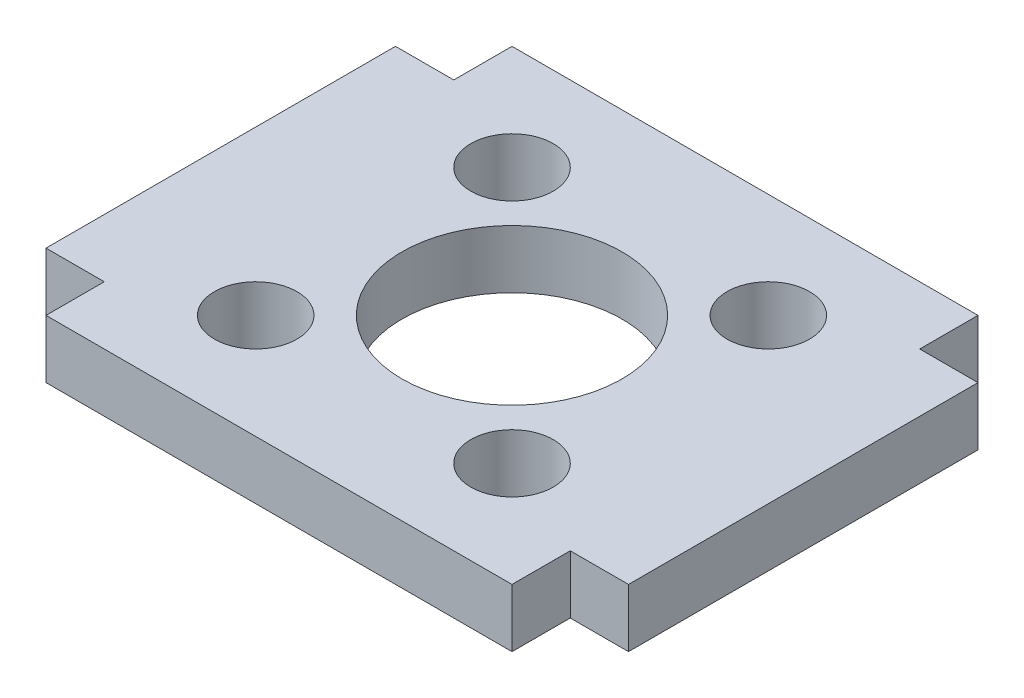
ISO-10303-21;
HEADER;
FILE_DESCRIPTION(('STEP AP214'),'2;1');
FILE_NAME('part.step','',(''),(''),'','','');
FILE_SCHEMA(('AUTOMOTIVE_DESIGN { 1 0 10303 214 1 1 1 1 }'));
ENDSEC;
DATA;
#1=APPLICATION_CONTEXT('core data for automotive mechanical design processes');
#2=APPLICATION_PROTOCOL_DEFINITION('international standard','automotive_design',2000,#1);
#3=PRODUCT_CONTEXT('',#1,'mechanical');
#4=PRODUCT('Part','Part','',(#3));
#5=PRODUCT_RELATED_PRODUCT_CATEGORY('part','',(#4));
#6=PRODUCT_DEFINITION_FORMATION('','',#4);
#7=PRODUCT_DEFINITION_CONTEXT('part definition',#1,'design');
#8=PRODUCT_DEFINITION('design','',#6,#7);
#9=PRODUCT_DEFINITION_SHAPE('','',#8);
#10=(LENGTH_UNIT() NAMED_UNIT(*) SI_UNIT(.MILLI.,.METRE.));
#11=(NAMED_UNIT(*) PLANE_ANGLE_UNIT() SI_UNIT($,.RADIAN.));
#12=(NAMED_UNIT(*) SI_UNIT($,.STERADIAN.) SOLID_ANGLE_UNIT());
#13=UNCERTAINTY_MEASURE_WITH_UNIT(LENGTH_MEASURE(1.E-05),#10,'distance_accuracy_value','');
#14=(GEOMETRIC_REPRESENTATION_CONTEXT(3) GLOBAL_UNCERTAINTY_ASSIGNED_CONTEXT((#13)) GLOBAL_UNIT_ASSIGNED_CONTEXT((#10,
#11,#12)) REPRESENTATION_CONTEXT('',''));
#15=CARTESIAN_POINT('',(0.,0.,0.));
#16=DIRECTION('',(0.,0.,1.));
#17=DIRECTION('',(1.,0.,0.));
#18=AXIS2_PLACEMENT_3D('',#15,#16,#17);
#19=CARTESIAN_POINT('',(-12.7,3.175,-9.52500000000001));
#20=DIRECTION('',(1.,0.,0.));
#21=DIRECTION('',(0.,0.,-1.));
#22=AXIS2_PLACEMENT_3D('',#19,#20,#21);
#23=PLANE('',#22);
#24=DIRECTION('',(0.,0.,1.));
#25=VECTOR('',#24,1.);
#26=CARTESIAN_POINT('',(-12.7,0.,-9.52500000000001));
#27=LINE('',#26,#25);
#28=CARTESIAN_POINT('',(-12.7,0.,-12.7));
#29=VERTEX_POINT('',#28);
#30=CARTESIAN_POINT('',(-12.7,0.,-9.52500000000001));
#31=VERTEX_POINT('',#30);
#32=EDGE_CURVE('E179',#29,#31,#27,.T.);
#33=ORIENTED_EDGE('',*,*,#32,.T.);
#34=DIRECTION('',(0.,-1.,0.));
#35=VECTOR('',#34,1.);
#36=CARTESIAN_POINT('',(-12.7,3.175,-9.52500000000001));
#37=LINE('',#36,#35);
#38=CARTESIAN_POINT('',(-12.7,3.175,-9.52500000000001));
#39=VERTEX_POINT('',#38);
#40=EDGE_CURVE('E11',#39,#31,#37,.T.);
#41=ORIENTED_EDGE('',*,*,#40,.F.);
#42=DIRECTION('',(0.,0.,1.));
#43=VECTOR('',#42,1.);
#44=CARTESIAN_POINT('',(-12.7,3.175,-9.52500000000001));
#45=LINE('',#44,#43);
#46=CARTESIAN_POINT('',(-12.7,3.175,-12.7));
#47=VERTEX_POINT('',#46);
#48=EDGE_CURVE('E208',#47,#39,#45,.T.);
#49=ORIENTED_EDGE('',*,*,#48,.F.);
#50=DIRECTION('',(0.,-1.,0.));
#51=VECTOR('',#50,1.);
#52=CARTESIAN_POINT('',(-12.7,3.175,-12.7));
#53=LINE('',#52,#51);
#54=EDGE_CURVE('E175',#47,#29,#53,.T.);
#55=ORIENTED_EDGE('',*,*,#54,.T.);
#56=EDGE_LOOP('',(#33,#41,#49,#55));
#57=FACE_BOUND('',#56,.T.);
#58=ADVANCED_FACE('F43',(#57),#23,.F.);
#59=CARTESIAN_POINT('',(-12.7,3.175,-9.52500000000001));
#60=DIRECTION('',(0.,0.,1.));
#61=DIRECTION('',(1.,0.,0.));
#62=AXIS2_PLACEMENT_3D('',#59,#60,#61);
#63=PLANE('',#62);
#64=DIRECTION('',(-1.,0.,0.));
#65=VECTOR('',#64,1.);
#66=CARTESIAN_POINT('',(-12.7,0.,-9.52500000000001));
#67=LINE('',#66,#65);
#68=CARTESIAN_POINT('',(-15.875,0.,-9.52500000000001));
#69=VERTEX_POINT('',#68);
#70=EDGE_CURVE('E183',#31,#69,#67,.T.);
#71=ORIENTED_EDGE('',*,*,#70,.T.);
#72=DIRECTION('',(0.,-1.,0.));
#73=VECTOR('',#72,1.);
#74=CARTESIAN_POINT('',(-15.875,3.175,-9.52500000000001));
#75=LINE('',#74,#73);
#76=CARTESIAN_POINT('',(-15.875,3.175,-9.52500000000001));
#77=VERTEX_POINT('',#76);
#78=EDGE_CURVE('E52',#77,#69,#75,.T.);
#79=ORIENTED_EDGE('',*,*,#78,.F.);
#80=DIRECTION('',(-1.,0.,0.));
#81=VECTOR('',#80,1.);
#82=CARTESIAN_POINT('',(-12.7,3.175,-9.52500000000001));
#83=LINE('',#82,#81);
#84=EDGE_CURVE('E125',#39,#77,#83,.T.);
#85=ORIENTED_EDGE('',*,*,#84,.F.);
#86=ORIENTED_EDGE('',*,*,#40,.T.);
#87=EDGE_LOOP('',(#71,#79,#85,#86));
#88=FACE_BOUND('',#87,.T.);
#89=ADVANCED_FACE('F290',(#88),#63,.F.);
#90=CARTESIAN_POINT('',(-15.875,3.175,-9.52500000000001));
#91=DIRECTION('',(1.,0.,0.));
#92=DIRECTION('',(0.,0.,-1.));
#93=AXIS2_PLACEMENT_3D('',#90,#91,#92);
#94=PLANE('',#93);
#95=DIRECTION('',(0.,0.,1.));
#96=VECTOR('',#95,1.);
#97=CARTESIAN_POINT('',(-15.875,0.,-9.52500000000001));
#98=LINE('',#97,#96);
#99=CARTESIAN_POINT('',(-15.875,0.,9.52499999999999));
#100=VERTEX_POINT('',#99);
#101=EDGE_CURVE('E187',#69,#100,#98,.T.);
#102=ORIENTED_EDGE('',*,*,#101,.T.);
#103=DIRECTION('',(0.,-1.,0.));
#104=VECTOR('',#103,1.);
#105=CARTESIAN_POINT('',(-15.875,3.175,9.52499999999999));
#106=LINE('',#105,#104);
#107=CARTESIAN_POINT('',(-15.875,3.175,9.52499999999999));
#108=VERTEX_POINT('',#107);
#109=EDGE_CURVE('E228',#108,#100,#106,.T.);
#110=ORIENTED_EDGE('',*,*,#109,.F.);
#111=DIRECTION('',(0.,0.,1.));
#112=VECTOR('',#111,1.);
#113=CARTESIAN_POINT('',(-15.875,3.175,-9.52500000000001));
#114=LINE('',#113,#112);
#115=EDGE_CURVE('E238',#77,#108,#114,.T.);
#116=ORIENTED_EDGE('',*,*,#115,.F.);
#117=ORIENTED_EDGE('',*,*,#78,.T.);
#118=EDGE_LOOP('',(#102,#110,#116,#117));
#119=FACE_BOUND('',#118,.T.);
#120=ADVANCED_FACE('F236',(#119),#94,.F.);
#121=CARTESIAN_POINT('',(-15.875,3.175,9.52499999999999));
#122=DIRECTION('',(0.,0.,-1.));
#123=DIRECTION('',(-1.,0.,0.));
#124=AXIS2_PLACEMENT_3D('',#121,#122,#123);
#125=PLANE('',#124);
#126=DIRECTION('',(1.,0.,0.));
#127=VECTOR('',#126,1.);
#128=CARTESIAN_POINT('',(-15.875,0.,9.52499999999999));
#129=LINE('',#128,#127);
#130=CARTESIAN_POINT('',(-12.7,0.,9.52499999999999));
#131=VERTEX_POINT('',#130);
#132=EDGE_CURVE('E190',#100,#131,#129,.T.);
#133=ORIENTED_EDGE('',*,*,#132,.T.);
#134=DIRECTION('',(0.,-1.,0.));
#135=VECTOR('',#134,1.);
#136=CARTESIAN_POINT('',(-12.7,3.175,9.52499999999999));
#137=LINE('',#136,#135);
#138=CARTESIAN_POINT('',(-12.7,3.175,9.52499999999999));
#139=VERTEX_POINT('',#138);
#140=EDGE_CURVE('E225',#139,#131,#137,.T.);
#141=ORIENTED_EDGE('',*,*,#140,.F.);
#142=DIRECTION('',(1.,0.,0.));
#143=VECTOR('',#142,1.);
#144=CARTESIAN_POINT('',(-15.875,3.175,9.52499999999999));
#145=LINE('',#144,#143);
#146=EDGE_CURVE('E256',#108,#139,#145,.T.);
#147=ORIENTED_EDGE('',*,*,#146,.F.);
#148=ORIENTED_EDGE('',*,*,#109,.T.);
#149=EDGE_LOOP('',(#133,#141,#147,#148));
#150=FACE_BOUND('',#149,.T.);
#151=ADVANCED_FACE('F247',(#150),#125,.F.);
#152=CARTESIAN_POINT('',(-12.7,3.175,12.7));
#153=DIRECTION('',(1.,0.,0.));
#154=DIRECTION('',(0.,0.,-1.));
#155=AXIS2_PLACEMENT_3D('',#152,#153,#154);
#156=PLANE('',#155);
#157=DIRECTION('',(0.,0.,1.));
#158=VECTOR('',#157,1.);
#159=CARTESIAN_POINT('',(-12.7,0.,12.7));
#160=LINE('',#159,#158);
#161=CARTESIAN_POINT('',(-12.7,0.,12.7));
#162=VERTEX_POINT('',#161);
#163=EDGE_CURVE('E192',#131,#162,#160,.T.);
#164=ORIENTED_EDGE('',*,*,#163,.T.);
#165=DIRECTION('',(0.,-1.,0.));
#166=VECTOR('',#165,1.);
#167=CARTESIAN_POINT('',(-12.7,3.175,12.7));
#168=LINE('',#167,#166);
#169=CARTESIAN_POINT('',(-12.7,3.175,12.7));
#170=VERTEX_POINT('',#169);
#171=EDGE_CURVE('E222',#170,#162,#168,.T.);
#172=ORIENTED_EDGE('',*,*,#171,.F.);
#173=DIRECTION('',(0.,0.,1.));
#174=VECTOR('',#173,1.);
#175=CARTESIAN_POINT('',(-12.7,3.175,12.7));
#176=LINE('',#175,#174);
#177=EDGE_CURVE('E253',#139,#170,#176,.T.);
#178=ORIENTED_EDGE('',*,*,#177,.F.);
#179=ORIENTED_EDGE('',*,*,#140,.T.);
#180=EDGE_LOOP('',(#164,#172,#178,#179));
#181=FACE_BOUND('',#180,.T.);
#182=ADVANCED_FACE('F251',(#181),#156,.F.);
#183=CARTESIAN_POINT('',(12.7,3.175,12.7));
#184=DIRECTION('',(0.,0.,-1.));
#185=DIRECTION('',(-1.,0.,0.));
#186=AXIS2_PLACEMENT_3D('',#183,#184,#185);
#187=PLANE('',#186);
#188=DIRECTION('',(1.,0.,0.));
#189=VECTOR('',#188,1.);
#190=CARTESIAN_POINT('',(12.7,0.,12.7));
#191=LINE('',#190,#189);
#192=CARTESIAN_POINT('',(12.7,0.,12.7));
#193=VERTEX_POINT('',#192);
#194=EDGE_CURVE('E194',#162,#193,#191,.T.);
#195=ORIENTED_EDGE('',*,*,#194,.T.);
#196=DIRECTION('',(0.,-1.,0.));
#197=VECTOR('',#196,1.);
#198=CARTESIAN_POINT('',(12.7,3.175,12.7));
#199=LINE('',#198,#197);
#200=CARTESIAN_POINT('',(12.7,3.175,12.7));
#201=VERTEX_POINT('',#200);
#202=EDGE_CURVE('E219',#201,#193,#199,.T.);
#203=ORIENTED_EDGE('',*,*,#202,.F.);
#204=DIRECTION('',(1.,0.,0.));
#205=VECTOR('',#204,1.);
#206=CARTESIAN_POINT('',(12.7,3.175,12.7));
#207=LINE('',#206,#205);
#208=EDGE_CURVE('E255',#170,#201,#207,.T.);
#209=ORIENTED_EDGE('',*,*,#208,.F.);
#210=ORIENTED_EDGE('',*,*,#171,.T.);
#211=EDGE_LOOP('',(#195,#203,#209,#210));
#212=FACE_BOUND('',#211,.T.);
#213=ADVANCED_FACE('F303',(#212),#187,.F.);
#214=CARTESIAN_POINT('',(12.7,3.175,12.7));
#215=DIRECTION('',(-1.,0.,0.));
#216=DIRECTION('',(0.,0.,1.));
#217=AXIS2_PLACEMENT_3D('',#214,#215,#216);
#218=PLANE('',#217);
#219=DIRECTION('',(0.,0.,-1.));
#220=VECTOR('',#219,1.);
#221=CARTESIAN_POINT('',(12.7,0.,12.7));
#222=LINE('',#221,#220);
#223=CARTESIAN_POINT('',(12.7,0.,9.52499999999999));
#224=VERTEX_POINT('',#223);
#225=EDGE_CURVE('E196',#193,#224,#222,.T.);
#226=ORIENTED_EDGE('',*,*,#225,.T.);
#227=DIRECTION('',(0.,-1.,0.));
#228=VECTOR('',#227,1.);
#229=CARTESIAN_POINT('',(12.7,3.175,9.52499999999999));
#230=LINE('',#229,#228);
#231=CARTESIAN_POINT('',(12.7,3.175,9.52499999999999));
#232=VERTEX_POINT('',#231);
#233=EDGE_CURVE('E216',#232,#224,#230,.T.);
#234=ORIENTED_EDGE('',*,*,#233,.F.);
#235=DIRECTION('',(0.,0.,-1.));
#236=VECTOR('',#235,1.);
#237=CARTESIAN_POINT('',(12.7,3.175,12.7));
#238=LINE('',#237,#236);
#239=EDGE_CURVE('E258',#201,#232,#238,.T.);
#240=ORIENTED_EDGE('',*,*,#239,.F.);
#241=ORIENTED_EDGE('',*,*,#202,.T.);
#242=EDGE_LOOP('',(#226,#234,#240,#241));
#243=FACE_BOUND('',#242,.T.);
#244=ADVANCED_FACE('F306',(#243),#218,.F.);
#245=CARTESIAN_POINT('',(15.875,3.175,9.52499999999999));
#246=DIRECTION('',(0.,0.,-1.));
#247=DIRECTION('',(-1.,0.,0.));
#248=AXIS2_PLACEMENT_3D('',#245,#246,#247);
#249=PLANE('',#248);
#250=DIRECTION('',(1.,0.,0.));
#251=VECTOR('',#250,1.);
#252=CARTESIAN_POINT('',(15.875,0.,9.52499999999999));
#253=LINE('',#252,#251);
#254=CARTESIAN_POINT('',(15.875,0.,9.52499999999999));
#255=VERTEX_POINT('',#254);
#256=EDGE_CURVE('E198',#224,#255,#253,.T.);
#257=ORIENTED_EDGE('',*,*,#256,.T.);
#258=DIRECTION('',(0.,-1.,0.));
#259=VECTOR('',#258,1.);
#260=CARTESIAN_POINT('',(15.875,3.175,9.52499999999999));
#261=LINE('',#260,#259);
#262=CARTESIAN_POINT('',(15.875,3.175,9.52499999999999));
#263=VERTEX_POINT('',#262);
#264=EDGE_CURVE('E213',#263,#255,#261,.T.);
#265=ORIENTED_EDGE('',*,*,#264,.F.);
#266=DIRECTION('',(1.,0.,0.));
#267=VECTOR('',#266,1.);
#268=CARTESIAN_POINT('',(15.875,3.175,9.52499999999999));
#269=LINE('',#268,#267);
#270=EDGE_CURVE('E264',#232,#263,#269,.T.);
#271=ORIENTED_EDGE('',*,*,#270,.F.);
#272=ORIENTED_EDGE('',*,*,#233,.T.);
#273=EDGE_LOOP('',(#257,#265,#271,#272));
#274=FACE_BOUND('',#273,.T.);
#275=ADVANCED_FACE('F270',(#274),#249,.F.);
#276=CARTESIAN_POINT('',(15.875,3.175,-9.52500000000001));
#277=DIRECTION('',(-1.,0.,0.));
#278=DIRECTION('',(0.,0.,1.));
#279=AXIS2_PLACEMENT_3D('',#276,#277,#278);
#280=PLANE('',#279);
#281=DIRECTION('',(0.,0.,-1.));
#282=VECTOR('',#281,1.);
#283=CARTESIAN_POINT('',(15.875,0.,-9.52500000000001));
#284=LINE('',#283,#282);
#285=CARTESIAN_POINT('',(15.875,0.,-9.52500000000001));
#286=VERTEX_POINT('',#285);
#287=EDGE_CURVE('E200',#255,#286,#284,.T.);
#288=ORIENTED_EDGE('',*,*,#287,.T.);
#289=DIRECTION('',(0.,-1.,0.));
#290=VECTOR('',#289,1.);
#291=CARTESIAN_POINT('',(15.875,3.175,-9.52500000000001));
#292=LINE('',#291,#290);
#293=CARTESIAN_POINT('',(15.875,3.175,-9.52500000000001));
#294=VERTEX_POINT('',#293);
#295=EDGE_CURVE('E167',#294,#286,#292,.T.);
#296=ORIENTED_EDGE('',*,*,#295,.F.);
#297=DIRECTION('',(0.,0.,-1.));
#298=VECTOR('',#297,1.);
#299=CARTESIAN_POINT('',(15.875,3.175,-9.52500000000001));
#300=LINE('',#299,#298);
#301=EDGE_CURVE('E156',#263,#294,#300,.T.);
#302=ORIENTED_EDGE('',*,*,#301,.F.);
#303=ORIENTED_EDGE('',*,*,#264,.T.);
#304=EDGE_LOOP('',(#288,#296,#302,#303));
#305=FACE_BOUND('',#304,.T.);
#306=ADVANCED_FACE('F274',(#305),#280,.F.);
#307=CARTESIAN_POINT('',(12.7,3.175,-9.52500000000001));
#308=DIRECTION('',(0.,0.,1.));
#309=DIRECTION('',(1.,0.,0.));
#310=AXIS2_PLACEMENT_3D('',#307,#308,#309);
#311=PLANE('',#310);
#312=DIRECTION('',(-1.,0.,0.));
#313=VECTOR('',#312,1.);
#314=CARTESIAN_POINT('',(12.7,0.,-9.52500000000001));
#315=LINE('',#314,#313);
#316=CARTESIAN_POINT('',(12.7,0.,-9.52500000000001));
#317=VERTEX_POINT('',#316);
#318=EDGE_CURVE('E165',#286,#317,#315,.T.);
#319=ORIENTED_EDGE('',*,*,#318,.T.);
#320=DIRECTION('',(0.,-1.,0.));
#321=VECTOR('',#320,1.);
#322=CARTESIAN_POINT('',(12.7,3.175,-9.52500000000001));
#323=LINE('',#322,#321);
#324=CARTESIAN_POINT('',(12.7,3.175,-9.52500000000001));
#325=VERTEX_POINT('',#324);
#326=EDGE_CURVE('E162',#325,#317,#323,.T.);
#327=ORIENTED_EDGE('',*,*,#326,.F.);
#328=DIRECTION('',(-1.,0.,0.));
#329=VECTOR('',#328,1.);
#330=CARTESIAN_POINT('',(12.7,3.175,-9.52500000000001));
#331=LINE('',#330,#329);
#332=EDGE_CURVE('E150',#294,#325,#331,.T.);
#333=ORIENTED_EDGE('',*,*,#332,.F.);
#334=ORIENTED_EDGE('',*,*,#295,.T.);
#335=EDGE_LOOP('',(#319,#327,#333,#334));
#336=FACE_BOUND('',#335,.T.);
#337=ADVANCED_FACE('F163',(#336),#311,.F.);
#338=CARTESIAN_POINT('',(12.7,3.175,-9.52500000000001));
#339=DIRECTION('',(-1.,0.,0.));
#340=DIRECTION('',(0.,0.,1.));
#341=AXIS2_PLACEMENT_3D('',#338,#339,#340);
#342=PLANE('',#341);
#343=DIRECTION('',(0.,0.,-1.));
#344=VECTOR('',#343,1.);
#345=CARTESIAN_POINT('',(12.7,0.,-9.52500000000001));
#346=LINE('',#345,#344);
#347=CARTESIAN_POINT('',(12.7,0.,-12.7));
#348=VERTEX_POINT('',#347);
#349=EDGE_CURVE('E109',#317,#348,#346,.T.);
#350=ORIENTED_EDGE('',*,*,#349,.T.);
#351=DIRECTION('',(0.,-1.,0.));
#352=VECTOR('',#351,1.);
#353=CARTESIAN_POINT('',(12.7,3.175,-12.7));
#354=LINE('',#353,#352);
#355=CARTESIAN_POINT('',(12.7,3.175,-12.7));
#356=VERTEX_POINT('',#355);
#357=EDGE_CURVE('E168',#356,#348,#354,.T.);
#358=ORIENTED_EDGE('',*,*,#357,.F.);
#359=DIRECTION('',(0.,0.,-1.));
#360=VECTOR('',#359,1.);
#361=CARTESIAN_POINT('',(12.7,3.175,-9.52500000000001));
#362=LINE('',#361,#360);
#363=EDGE_CURVE('E154',#325,#356,#362,.T.);
#364=ORIENTED_EDGE('',*,*,#363,.F.);
#365=ORIENTED_EDGE('',*,*,#326,.T.);
#366=EDGE_LOOP('',(#350,#358,#364,#365));
#367=FACE_BOUND('',#366,.T.);
#368=ADVANCED_FACE('F170',(#367),#342,.F.);
#369=CARTESIAN_POINT('',(12.7,3.175,-12.7));
#370=DIRECTION('',(0.,0.,1.));
#371=DIRECTION('',(1.,0.,0.));
#372=AXIS2_PLACEMENT_3D('',#369,#370,#371);
#373=PLANE('',#372);
#374=DIRECTION('',(-1.,0.,0.));
#375=VECTOR('',#374,1.);
#376=CARTESIAN_POINT('',(12.7,0.,-12.7));
#377=LINE('',#376,#375);
#378=EDGE_CURVE('E115',#348,#29,#377,.T.);
#379=ORIENTED_EDGE('',*,*,#378,.T.);
#380=ORIENTED_EDGE('',*,*,#54,.F.);
#381=DIRECTION('',(-1.,0.,0.));
#382=VECTOR('',#381,1.);
#383=CARTESIAN_POINT('',(12.7,3.175,-12.7));
#384=LINE('',#383,#382);
#385=EDGE_CURVE('E63',#356,#47,#384,.T.);
#386=ORIENTED_EDGE('',*,*,#385,.F.);
#387=ORIENTED_EDGE('',*,*,#357,.T.);
#388=EDGE_LOOP('',(#379,#380,#386,#387));
#389=FACE_BOUND('',#388,.T.);
#390=ADVANCED_FACE('F278',(#389),#373,.F.);
#391=CARTESIAN_POINT('',(0.,3.175,0.));
#392=DIRECTION('',(0.,1.,0.));
#393=DIRECTION('',(0.,0.,1.));
#394=AXIS2_PLACEMENT_3D('',#391,#392,#393);
#395=PLANE('',#394);
#396=CARTESIAN_POINT('',(-6.985,3.175,-6.985));
#397=DIRECTION('',(0.,1.,0.));
#398=DIRECTION('',(0.,0.,1.));
#399=AXIS2_PLACEMENT_3D('',#396,#397,#398);
#400=CIRCLE('',#399,2.2479);
#401=CARTESIAN_POINT('',(-6.985,3.175,-4.73710000000001));
#402=VERTEX_POINT('',#401);
#403=EDGE_CURVE('E402',#402,#402,#400,.T.);
#404=ORIENTED_EDGE('',*,*,#403,.F.);
#405=EDGE_LOOP('',(#404));
#406=FACE_BOUND('',#405,.T.);
#407=CARTESIAN_POINT('',(6.985,3.175,-6.985));
#408=DIRECTION('',(0.,1.,0.));
#409=DIRECTION('',(0.,0.,1.));
#410=AXIS2_PLACEMENT_3D('',#407,#408,#409);
#411=CIRCLE('',#410,2.2479);
#412=CARTESIAN_POINT('',(6.985,3.175,-4.7371));
#413=VERTEX_POINT('',#412);
#414=EDGE_CURVE('E408',#413,#413,#411,.T.);
#415=ORIENTED_EDGE('',*,*,#414,.F.);
#416=EDGE_LOOP('',(#415));
#417=FACE_BOUND('',#416,.T.);
#418=CARTESIAN_POINT('',(6.985,3.175,6.985));
#419=DIRECTION('',(0.,1.,0.));
#420=DIRECTION('',(0.,0.,1.));
#421=AXIS2_PLACEMENT_3D('',#418,#419,#420);
#422=CIRCLE('',#421,2.2479);
#423=CARTESIAN_POINT('',(6.985,3.175,9.2329));
#424=VERTEX_POINT('',#423);
#425=EDGE_CURVE('E418',#424,#424,#422,.T.);
#426=ORIENTED_EDGE('',*,*,#425,.F.);
#427=EDGE_LOOP('',(#426));
#428=FACE_BOUND('',#427,.T.);
#429=CARTESIAN_POINT('',(-6.985,3.175,6.985));
#430=DIRECTION('',(0.,1.,0.));
#431=DIRECTION('',(0.,0.,1.));
#432=AXIS2_PLACEMENT_3D('',#429,#430,#431);
#433=CIRCLE('',#432,2.2479);
#434=CARTESIAN_POINT('',(-6.985,3.175,9.2329));
#435=VERTEX_POINT('',#434);
#436=EDGE_CURVE('E424',#435,#435,#433,.T.);
#437=ORIENTED_EDGE('',*,*,#436,.F.);
#438=EDGE_LOOP('',(#437));
#439=FACE_BOUND('',#438,.T.);
#440=CARTESIAN_POINT('',(0.,3.175,0.));
#441=DIRECTION('',(0.,1.,0.));
#442=DIRECTION('',(0.,0.,1.));
#443=AXIS2_PLACEMENT_3D('',#440,#441,#442);
#444=CIRCLE('',#443,6.);
#445=CARTESIAN_POINT('',(0.,3.175,6.));
#446=VERTEX_POINT('',#445);
#447=EDGE_CURVE('E431',#446,#446,#444,.T.);
#448=ORIENTED_EDGE('',*,*,#447,.F.);
#449=EDGE_LOOP('',(#448));
#450=FACE_BOUND('',#449,.T.);
#451=ORIENTED_EDGE('',*,*,#48,.T.);
#452=ORIENTED_EDGE('',*,*,#84,.T.);
#453=ORIENTED_EDGE('',*,*,#115,.T.);
#454=ORIENTED_EDGE('',*,*,#146,.T.);
#455=ORIENTED_EDGE('',*,*,#177,.T.);
#456=ORIENTED_EDGE('',*,*,#208,.T.);
#457=ORIENTED_EDGE('',*,*,#239,.T.);
#458=ORIENTED_EDGE('',*,*,#270,.T.);
#459=ORIENTED_EDGE('',*,*,#301,.T.);
#460=ORIENTED_EDGE('',*,*,#332,.T.);
#461=ORIENTED_EDGE('',*,*,#363,.T.);
#462=ORIENTED_EDGE('',*,*,#385,.T.);
#463=EDGE_LOOP('',(#451,#452,#453,#454,#455,#456,#457,#458,#459,#460,#461,#462));
#464=FACE_BOUND('',#463,.T.);
#465=ADVANCED_FACE('F152',(#406,#417,#428,#439,#450,#464),#395,.T.);
#466=CARTESIAN_POINT('',(0.,0.,0.));
#467=DIRECTION('',(0.,1.,0.));
#468=DIRECTION('',(0.,0.,1.));
#469=AXIS2_PLACEMENT_3D('',#466,#467,#468);
#470=PLANE('',#469);
#471=CARTESIAN_POINT('',(-6.985,0.,-6.985));
#472=DIRECTION('',(0.,1.,0.));
#473=DIRECTION('',(0.,0.,1.));
#474=AXIS2_PLACEMENT_3D('',#471,#472,#473);
#475=CIRCLE('',#474,2.2479);
#476=CARTESIAN_POINT('',(-6.985,0.,-4.7371));
#477=VERTEX_POINT('',#476);
#478=EDGE_CURVE('E399',#477,#477,#475,.T.);
#479=ORIENTED_EDGE('',*,*,#478,.T.);
#480=EDGE_LOOP('',(#479));
#481=FACE_BOUND('',#480,.T.);
#482=CARTESIAN_POINT('',(6.985,0.,-6.985));
#483=DIRECTION('',(0.,1.,0.));
#484=DIRECTION('',(0.,0.,1.));
#485=AXIS2_PLACEMENT_3D('',#482,#483,#484);
#486=CIRCLE('',#485,2.2479);
#487=CARTESIAN_POINT('',(6.985,0.,-4.7371));
#488=VERTEX_POINT('',#487);
#489=EDGE_CURVE('E414',#488,#488,#486,.T.);
#490=ORIENTED_EDGE('',*,*,#489,.T.);
#491=EDGE_LOOP('',(#490));
#492=FACE_BOUND('',#491,.T.);
#493=CARTESIAN_POINT('',(6.985,0.,6.985));
#494=DIRECTION('',(0.,1.,0.));
#495=DIRECTION('',(0.,0.,1.));
#496=AXIS2_PLACEMENT_3D('',#493,#494,#495);
#497=CIRCLE('',#496,2.2479);
#498=CARTESIAN_POINT('',(6.985,0.,9.2329));
#499=VERTEX_POINT('',#498);
#500=EDGE_CURVE('E421',#499,#499,#497,.T.);
#501=ORIENTED_EDGE('',*,*,#500,.T.);
#502=EDGE_LOOP('',(#501));
#503=FACE_BOUND('',#502,.T.);
#504=CARTESIAN_POINT('',(-6.985,0.,6.985));
#505=DIRECTION('',(0.,1.,0.));
#506=DIRECTION('',(0.,0.,1.));
#507=AXIS2_PLACEMENT_3D('',#504,#505,#506);
#508=CIRCLE('',#507,2.2479);
#509=CARTESIAN_POINT('',(-6.985,0.,9.2329));
#510=VERTEX_POINT('',#509);
#511=EDGE_CURVE('E427',#510,#510,#508,.T.);
#512=ORIENTED_EDGE('',*,*,#511,.T.);
#513=EDGE_LOOP('',(#512));
#514=FACE_BOUND('',#513,.T.);
#515=CARTESIAN_POINT('',(0.,0.,0.));
#516=DIRECTION('',(0.,1.,0.));
#517=DIRECTION('',(0.,0.,1.));
#518=AXIS2_PLACEMENT_3D('',#515,#516,#517);
#519=CIRCLE('',#518,6.);
#520=CARTESIAN_POINT('',(0.,0.,6.));
#521=VERTEX_POINT('',#520);
#522=EDGE_CURVE('E184',#521,#521,#519,.T.);
#523=ORIENTED_EDGE('',*,*,#522,.T.);
#524=EDGE_LOOP('',(#523));
#525=FACE_BOUND('',#524,.T.);
#526=ORIENTED_EDGE('',*,*,#32,.F.);
#527=ORIENTED_EDGE('',*,*,#378,.F.);
#528=ORIENTED_EDGE('',*,*,#349,.F.);
#529=ORIENTED_EDGE('',*,*,#318,.F.);
#530=ORIENTED_EDGE('',*,*,#287,.F.);
#531=ORIENTED_EDGE('',*,*,#256,.F.);
#532=ORIENTED_EDGE('',*,*,#225,.F.);
#533=ORIENTED_EDGE('',*,*,#194,.F.);
#534=ORIENTED_EDGE('',*,*,#163,.F.);
#535=ORIENTED_EDGE('',*,*,#132,.F.);
#536=ORIENTED_EDGE('',*,*,#101,.F.);
#537=ORIENTED_EDGE('',*,*,#70,.F.);
#538=EDGE_LOOP('',(#526,#527,#528,#529,#530,#531,#532,#533,#534,#535,#536,#537));
#539=FACE_BOUND('',#538,.T.);
#540=ADVANCED_FACE('F242',(#481,#492,#503,#514,#525,#539),#470,.F.);
#541=CARTESIAN_POINT('',(0.,0.,0.));
#542=DIRECTION('',(0.,1.,0.));
#543=DIRECTION('',(0.,0.,1.));
#544=AXIS2_PLACEMENT_3D('',#541,#542,#543);
#545=CYLINDRICAL_SURFACE('',#544,6.);
#546=ORIENTED_EDGE('',*,*,#522,.F.);
#547=EDGE_LOOP('',(#546));
#548=FACE_BOUND('',#547,.T.);
#549=ORIENTED_EDGE('',*,*,#447,.T.);
#550=EDGE_LOOP('',(#549));
#551=FACE_BOUND('',#550,.T.);
#552=ADVANCED_FACE('F334',(#548,#551),#545,.F.);
#553=CARTESIAN_POINT('',(-6.985,3.175,6.985));
#554=DIRECTION('',(0.,1.,0.));
#555=DIRECTION('',(0.,0.,1.));
#556=AXIS2_PLACEMENT_3D('',#553,#554,#555);
#557=CYLINDRICAL_SURFACE('',#556,2.2479);
#558=ORIENTED_EDGE('',*,*,#511,.F.);
#559=EDGE_LOOP('',(#558));
#560=FACE_BOUND('',#559,.T.);
#561=ORIENTED_EDGE('',*,*,#436,.T.);
#562=EDGE_LOOP('',(#561));
#563=FACE_BOUND('',#562,.T.);
#564=ADVANCED_FACE('F339',(#560,#563),#557,.F.);
#565=CARTESIAN_POINT('',(6.985,3.175,6.985));
#566=DIRECTION('',(0.,1.,0.));
#567=DIRECTION('',(0.,0.,1.));
#568=AXIS2_PLACEMENT_3D('',#565,#566,#567);
#569=CYLINDRICAL_SURFACE('',#568,2.2479);
#570=ORIENTED_EDGE('',*,*,#500,.F.);
#571=EDGE_LOOP('',(#570));
#572=FACE_BOUND('',#571,.T.);
#573=ORIENTED_EDGE('',*,*,#425,.T.);
#574=EDGE_LOOP('',(#573));
#575=FACE_BOUND('',#574,.T.);
#576=ADVANCED_FACE('F362',(#572,#575),#569,.F.);
#577=CARTESIAN_POINT('',(6.985,3.175,-6.985));
#578=DIRECTION('',(0.,1.,0.));
#579=DIRECTION('',(0.,0.,1.));
#580=AXIS2_PLACEMENT_3D('',#577,#578,#579);
#581=CYLINDRICAL_SURFACE('',#580,2.2479);
#582=ORIENTED_EDGE('',*,*,#489,.F.);
#583=EDGE_LOOP('',(#582));
#584=FACE_BOUND('',#583,.T.);
#585=ORIENTED_EDGE('',*,*,#414,.T.);
#586=EDGE_LOOP('',(#585));
#587=FACE_BOUND('',#586,.T.);
#588=ADVANCED_FACE('F372',(#584,#587),#581,.F.);
#589=CARTESIAN_POINT('',(-6.985,3.175,-6.985));
#590=DIRECTION('',(0.,1.,0.));
#591=DIRECTION('',(0.,0.,1.));
#592=AXIS2_PLACEMENT_3D('',#589,#590,#591);
#593=CYLINDRICAL_SURFACE('',#592,2.2479);
#594=ORIENTED_EDGE('',*,*,#478,.F.);
#595=EDGE_LOOP('',(#594));
#596=FACE_BOUND('',#595,.T.);
#597=ORIENTED_EDGE('',*,*,#403,.T.);
#598=EDGE_LOOP('',(#597));
#599=FACE_BOUND('',#598,.T.);
#600=ADVANCED_FACE('F382',(#596,#599),#593,.F.);
#601=CLOSED_SHELL('',(#58,#89,#120,#151,#182,#213,#244,#275,#306,#337,#368,#390,#465,#540,#552,
#564,#576,#588,#600));
#602=MANIFOLD_SOLID_BREP('B2',#601);
#603=ADVANCED_BREP_SHAPE_REPRESENTATION('',(#18,#602),#14);
#604=SHAPE_DEFINITION_REPRESENTATION(#9,#603);
ENDSEC;
END-ISO-10303-21;
